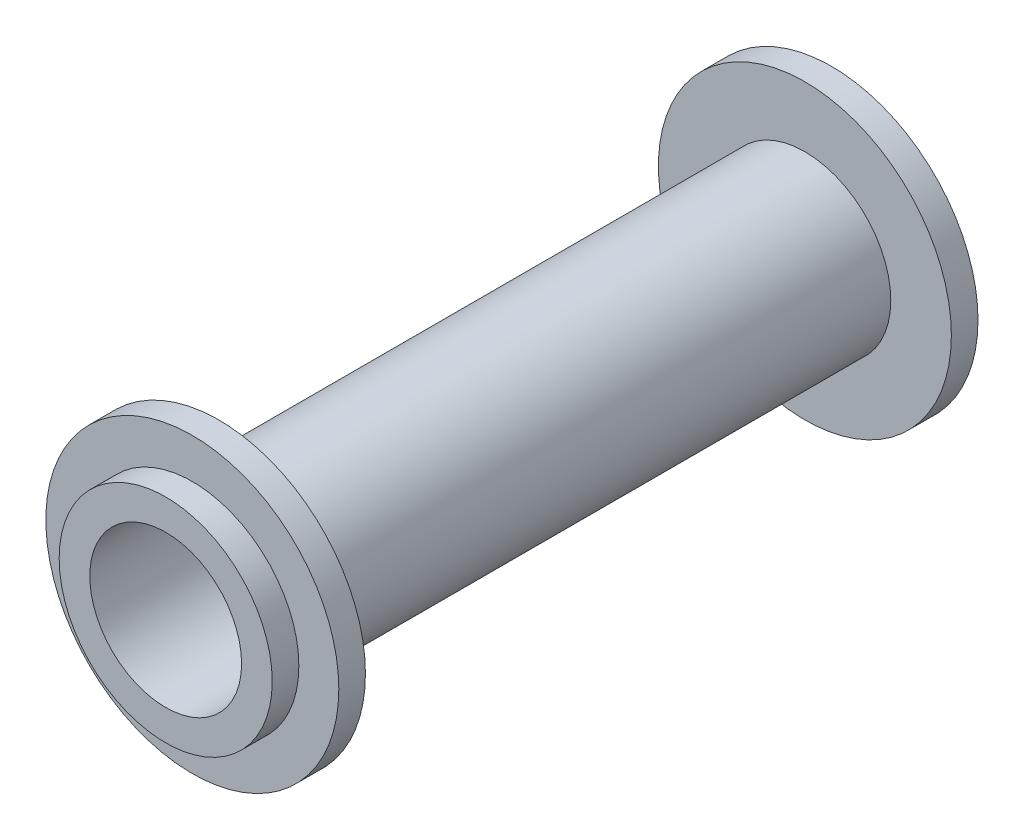
ISO-10303-21;
HEADER;
FILE_DESCRIPTION(('STEP AP214'),'2;1');
FILE_NAME('part.step','',(''),(''),'','','');
FILE_SCHEMA(('AUTOMOTIVE_DESIGN { 1 0 10303 214 1 1 1 1 }'));
ENDSEC;
DATA;
#1=APPLICATION_CONTEXT('core data for automotive mechanical design processes');
#2=APPLICATION_PROTOCOL_DEFINITION('international standard','automotive_design',2000,#1);
#3=PRODUCT_CONTEXT('',#1,'mechanical');
#4=PRODUCT('Part','Part','',(#3));
#5=PRODUCT_RELATED_PRODUCT_CATEGORY('part','',(#4));
#6=PRODUCT_DEFINITION_FORMATION('','',#4);
#7=PRODUCT_DEFINITION_CONTEXT('part definition',#1,'design');
#8=PRODUCT_DEFINITION('design','',#6,#7);
#9=PRODUCT_DEFINITION_SHAPE('','',#8);
#10=(LENGTH_UNIT() NAMED_UNIT(*) SI_UNIT(.MILLI.,.METRE.));
#11=(NAMED_UNIT(*) PLANE_ANGLE_UNIT() SI_UNIT($,.RADIAN.));
#12=(NAMED_UNIT(*) SI_UNIT($,.STERADIAN.) SOLID_ANGLE_UNIT());
#13=UNCERTAINTY_MEASURE_WITH_UNIT(LENGTH_MEASURE(1.E-05),#10,'distance_accuracy_value','');
#14=(GEOMETRIC_REPRESENTATION_CONTEXT(3) GLOBAL_UNCERTAINTY_ASSIGNED_CONTEXT((#13)) GLOBAL_UNIT_ASSIGNED_CONTEXT((#10,
#11,#12)) REPRESENTATION_CONTEXT('',''));
#15=CARTESIAN_POINT('',(0.,0.,0.));
#16=DIRECTION('',(0.,0.,1.));
#17=DIRECTION('',(1.,0.,0.));
#18=AXIS2_PLACEMENT_3D('',#15,#16,#17);
#19=CARTESIAN_POINT('',(0.,0.,50.));
#20=DIRECTION('',(0.,0.,1.));
#21=DIRECTION('',(1.,0.,0.));
#22=AXIS2_PLACEMENT_3D('',#19,#20,#21);
#23=PLANE('',#22);
#24=CARTESIAN_POINT('',(0.,0.,50.));
#25=DIRECTION('',(0.,0.,1.));
#26=DIRECTION('',(1.,0.,0.));
#27=AXIS2_PLACEMENT_3D('',#24,#25,#26);
#28=CIRCLE('',#27,11.);
#29=CARTESIAN_POINT('',(11.,0.,50.));
#30=VERTEX_POINT('',#29);
#31=EDGE_CURVE('E53',#30,#30,#28,.T.);
#32=ORIENTED_EDGE('',*,*,#31,.T.);
#33=EDGE_LOOP('',(#32));
#34=FACE_BOUND('',#33,.T.);
#35=CARTESIAN_POINT('',(0.,0.,50.));
#36=DIRECTION('',(0.,0.,1.));
#37=DIRECTION('',(1.,0.,0.));
#38=AXIS2_PLACEMENT_3D('',#35,#36,#37);
#39=CIRCLE('',#38,8.);
#40=CARTESIAN_POINT('',(8.,0.,50.));
#41=VERTEX_POINT('',#40);
#42=EDGE_CURVE('E62',#41,#41,#39,.T.);
#43=ORIENTED_EDGE('',*,*,#42,.F.);
#44=EDGE_LOOP('',(#43));
#45=FACE_BOUND('',#44,.T.);
#46=ADVANCED_FACE('F31',(#34,#45),#23,.T.);
#47=CARTESIAN_POINT('',(0.,0.,4.));
#48=DIRECTION('',(0.,0.,1.));
#49=DIRECTION('',(1.,0.,0.));
#50=AXIS2_PLACEMENT_3D('',#47,#48,#49);
#51=PLANE('',#50);
#52=CARTESIAN_POINT('',(0.,0.,4.));
#53=DIRECTION('',(0.,0.,1.));
#54=DIRECTION('',(1.,0.,0.));
#55=AXIS2_PLACEMENT_3D('',#52,#53,#54);
#56=CIRCLE('',#55,11.);
#57=CARTESIAN_POINT('',(11.,0.,4.));
#58=VERTEX_POINT('',#57);
#59=EDGE_CURVE('E42',#58,#58,#56,.T.);
#60=ORIENTED_EDGE('',*,*,#59,.T.);
#61=EDGE_LOOP('',(#60));
#62=FACE_BOUND('',#61,.T.);
#63=CARTESIAN_POINT('',(0.,0.,4.));
#64=DIRECTION('',(0.,0.,1.));
#65=DIRECTION('',(1.,0.,0.));
#66=AXIS2_PLACEMENT_3D('',#63,#64,#65);
#67=CIRCLE('',#66,6.45);
#68=CARTESIAN_POINT('',(6.45,0.,4.));
#69=VERTEX_POINT('',#68);
#70=EDGE_CURVE('E50',#69,#69,#67,.T.);
#71=ORIENTED_EDGE('',*,*,#70,.F.);
#72=EDGE_LOOP('',(#71));
#73=FACE_BOUND('',#72,.T.);
#74=ADVANCED_FACE('F97',(#62,#73),#51,.T.);
#75=CARTESIAN_POINT('',(0.,0.,2.));
#76=DIRECTION('',(0.,0.,-1.));
#77=DIRECTION('',(-1.,0.,0.));
#78=AXIS2_PLACEMENT_3D('',#75,#76,#77);
#79=CYLINDRICAL_SURFACE('',#78,8.);
#80=CARTESIAN_POINT('',(0.,0.,2.));
#81=DIRECTION('',(0.,0.,1.));
#82=DIRECTION('',(1.,0.,0.));
#83=AXIS2_PLACEMENT_3D('',#80,#81,#82);
#84=CIRCLE('',#83,8.);
#85=CARTESIAN_POINT('',(8.,0.,2.));
#86=VERTEX_POINT('',#85);
#87=EDGE_CURVE('E10',#86,#86,#84,.T.);
#88=ORIENTED_EDGE('',*,*,#87,.F.);
#89=EDGE_LOOP('',(#88));
#90=FACE_BOUND('',#89,.T.);
#91=CARTESIAN_POINT('',(0.,0.,0.));
#92=DIRECTION('',(0.,0.,1.));
#93=DIRECTION('',(1.,0.,0.));
#94=AXIS2_PLACEMENT_3D('',#91,#92,#93);
#95=CIRCLE('',#94,8.);
#96=CARTESIAN_POINT('',(8.,0.,0.));
#97=VERTEX_POINT('',#96);
#98=EDGE_CURVE('E35',#97,#97,#95,.T.);
#99=ORIENTED_EDGE('',*,*,#98,.T.);
#100=EDGE_LOOP('',(#99));
#101=FACE_BOUND('',#100,.T.);
#102=ADVANCED_FACE('F33',(#90,#101),#79,.T.);
#103=CARTESIAN_POINT('',(0.,0.,0.));
#104=DIRECTION('',(0.,0.,1.));
#105=DIRECTION('',(1.,0.,0.));
#106=AXIS2_PLACEMENT_3D('',#103,#104,#105);
#107=PLANE('',#106);
#108=CARTESIAN_POINT('',(0.,0.,0.));
#109=DIRECTION('',(0.,0.,1.));
#110=DIRECTION('',(1.,0.,0.));
#111=AXIS2_PLACEMENT_3D('',#108,#109,#110);
#112=CIRCLE('',#111,5.7);
#113=CARTESIAN_POINT('',(5.7,0.,0.));
#114=VERTEX_POINT('',#113);
#115=EDGE_CURVE('E65',#114,#114,#112,.T.);
#116=ORIENTED_EDGE('',*,*,#115,.T.);
#117=EDGE_LOOP('',(#116));
#118=FACE_BOUND('',#117,.T.);
#119=ORIENTED_EDGE('',*,*,#98,.F.);
#120=EDGE_LOOP('',(#119));
#121=FACE_BOUND('',#120,.T.);
#122=ADVANCED_FACE('F74',(#118,#121),#107,.F.);
#123=CARTESIAN_POINT('',(0.,0.,2.));
#124=DIRECTION('',(0.,0.,1.));
#125=DIRECTION('',(1.,0.,0.));
#126=AXIS2_PLACEMENT_3D('',#123,#124,#125);
#127=PLANE('',#126);
#128=CARTESIAN_POINT('',(0.,0.,2.));
#129=DIRECTION('',(0.,0.,1.));
#130=DIRECTION('',(1.,0.,0.));
#131=AXIS2_PLACEMENT_3D('',#128,#129,#130);
#132=CIRCLE('',#131,11.);
#133=CARTESIAN_POINT('',(11.,0.,2.));
#134=VERTEX_POINT('',#133);
#135=EDGE_CURVE('E44',#134,#134,#132,.T.);
#136=ORIENTED_EDGE('',*,*,#135,.F.);
#137=EDGE_LOOP('',(#136));
#138=FACE_BOUND('',#137,.T.);
#139=ORIENTED_EDGE('',*,*,#87,.T.);
#140=EDGE_LOOP('',(#139));
#141=FACE_BOUND('',#140,.T.);
#142=ADVANCED_FACE('F118',(#138,#141),#127,.F.);
#143=CARTESIAN_POINT('',(0.,0.,4.));
#144=DIRECTION('',(0.,0.,-1.));
#145=DIRECTION('',(-1.,0.,0.));
#146=AXIS2_PLACEMENT_3D('',#143,#144,#145);
#147=CYLINDRICAL_SURFACE('',#146,11.);
#148=ORIENTED_EDGE('',*,*,#59,.F.);
#149=EDGE_LOOP('',(#148));
#150=FACE_BOUND('',#149,.T.);
#151=ORIENTED_EDGE('',*,*,#135,.T.);
#152=EDGE_LOOP('',(#151));
#153=FACE_BOUND('',#152,.T.);
#154=ADVANCED_FACE('F115',(#150,#153),#147,.T.);
#155=CARTESIAN_POINT('',(0.,0.,48.));
#156=DIRECTION('',(0.,0.,-1.));
#157=DIRECTION('',(-1.,0.,0.));
#158=AXIS2_PLACEMENT_3D('',#155,#156,#157);
#159=CYLINDRICAL_SURFACE('',#158,6.45);
#160=CARTESIAN_POINT('',(0.,0.,48.));
#161=DIRECTION('',(0.,0.,1.));
#162=DIRECTION('',(1.,0.,0.));
#163=AXIS2_PLACEMENT_3D('',#160,#161,#162);
#164=CIRCLE('',#163,6.45);
#165=CARTESIAN_POINT('',(6.45,0.,48.));
#166=VERTEX_POINT('',#165);
#167=EDGE_CURVE('E47',#166,#166,#164,.T.);
#168=ORIENTED_EDGE('',*,*,#167,.F.);
#169=EDGE_LOOP('',(#168));
#170=FACE_BOUND('',#169,.T.);
#171=ORIENTED_EDGE('',*,*,#70,.T.);
#172=EDGE_LOOP('',(#171));
#173=FACE_BOUND('',#172,.T.);
#174=ADVANCED_FACE('F109',(#170,#173),#159,.T.);
#175=CARTESIAN_POINT('',(0.,0.,48.));
#176=DIRECTION('',(0.,0.,1.));
#177=DIRECTION('',(1.,0.,0.));
#178=AXIS2_PLACEMENT_3D('',#175,#176,#177);
#179=PLANE('',#178);
#180=CARTESIAN_POINT('',(0.,0.,48.));
#181=DIRECTION('',(0.,0.,1.));
#182=DIRECTION('',(1.,0.,0.));
#183=AXIS2_PLACEMENT_3D('',#180,#181,#182);
#184=CIRCLE('',#183,11.);
#185=CARTESIAN_POINT('',(11.,0.,48.));
#186=VERTEX_POINT('',#185);
#187=EDGE_CURVE('E56',#186,#186,#184,.T.);
#188=ORIENTED_EDGE('',*,*,#187,.F.);
#189=EDGE_LOOP('',(#188));
#190=FACE_BOUND('',#189,.T.);
#191=ORIENTED_EDGE('',*,*,#167,.T.);
#192=EDGE_LOOP('',(#191));
#193=FACE_BOUND('',#192,.T.);
#194=ADVANCED_FACE('F106',(#190,#193),#179,.F.);
#195=CARTESIAN_POINT('',(0.,0.,50.));
#196=DIRECTION('',(0.,0.,-1.));
#197=DIRECTION('',(-1.,0.,0.));
#198=AXIS2_PLACEMENT_3D('',#195,#196,#197);
#199=CYLINDRICAL_SURFACE('',#198,11.);
#200=ORIENTED_EDGE('',*,*,#31,.F.);
#201=EDGE_LOOP('',(#200));
#202=FACE_BOUND('',#201,.T.);
#203=ORIENTED_EDGE('',*,*,#187,.T.);
#204=EDGE_LOOP('',(#203));
#205=FACE_BOUND('',#204,.T.);
#206=ADVANCED_FACE('F92',(#202,#205),#199,.T.);
#207=CARTESIAN_POINT('',(0.,0.,52.));
#208=DIRECTION('',(0.,0.,-1.));
#209=DIRECTION('',(-1.,0.,0.));
#210=AXIS2_PLACEMENT_3D('',#207,#208,#209);
#211=CYLINDRICAL_SURFACE('',#210,8.);
#212=CARTESIAN_POINT('',(0.,0.,52.));
#213=DIRECTION('',(0.,0.,1.));
#214=DIRECTION('',(1.,0.,0.));
#215=AXIS2_PLACEMENT_3D('',#212,#213,#214);
#216=CIRCLE('',#215,8.);
#217=CARTESIAN_POINT('',(8.,0.,52.));
#218=VERTEX_POINT('',#217);
#219=EDGE_CURVE('E59',#218,#218,#216,.T.);
#220=ORIENTED_EDGE('',*,*,#219,.F.);
#221=EDGE_LOOP('',(#220));
#222=FACE_BOUND('',#221,.T.);
#223=ORIENTED_EDGE('',*,*,#42,.T.);
#224=EDGE_LOOP('',(#223));
#225=FACE_BOUND('',#224,.T.);
#226=ADVANCED_FACE('F86',(#222,#225),#211,.T.);
#227=CARTESIAN_POINT('',(0.,0.,52.));
#228=DIRECTION('',(0.,0.,1.));
#229=DIRECTION('',(1.,0.,0.));
#230=AXIS2_PLACEMENT_3D('',#227,#228,#229);
#231=PLANE('',#230);
#232=CARTESIAN_POINT('',(0.,0.,52.));
#233=DIRECTION('',(0.,0.,1.));
#234=DIRECTION('',(1.,0.,0.));
#235=AXIS2_PLACEMENT_3D('',#232,#233,#234);
#236=CIRCLE('',#235,5.7);
#237=CARTESIAN_POINT('',(5.7,0.,52.));
#238=VERTEX_POINT('',#237);
#239=EDGE_CURVE('E68',#238,#238,#236,.T.);
#240=ORIENTED_EDGE('',*,*,#239,.F.);
#241=EDGE_LOOP('',(#240));
#242=FACE_BOUND('',#241,.T.);
#243=ORIENTED_EDGE('',*,*,#219,.T.);
#244=EDGE_LOOP('',(#243));
#245=FACE_BOUND('',#244,.T.);
#246=ADVANCED_FACE('F80',(#242,#245),#231,.T.);
#247=CARTESIAN_POINT('',(0.,0.,0.));
#248=DIRECTION('',(0.,0.,1.));
#249=DIRECTION('',(1.,0.,0.));
#250=AXIS2_PLACEMENT_3D('',#247,#248,#249);
#251=CYLINDRICAL_SURFACE('',#250,5.7);
#252=ORIENTED_EDGE('',*,*,#115,.F.);
#253=EDGE_LOOP('',(#252));
#254=FACE_BOUND('',#253,.T.);
#255=ORIENTED_EDGE('',*,*,#239,.T.);
#256=EDGE_LOOP('',(#255));
#257=FACE_BOUND('',#256,.T.);
#258=ADVANCED_FACE('F77',(#254,#257),#251,.F.);
#259=CLOSED_SHELL('',(#46,#74,#102,#122,#142,#154,#174,#194,#206,#226,#246,#258));
#260=MANIFOLD_SOLID_BREP('B2',#259);
#261=ADVANCED_BREP_SHAPE_REPRESENTATION('',(#18,#260),#14);
#262=SHAPE_DEFINITION_REPRESENTATION(#9,#261);
ENDSEC;
END-ISO-10303-21;
